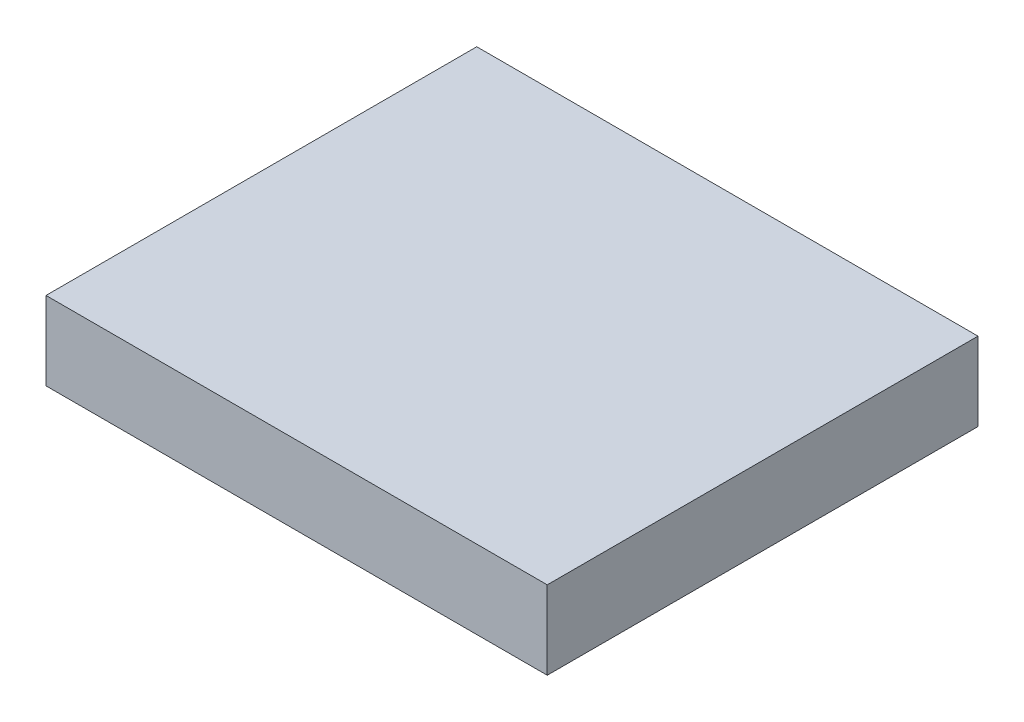
ISO-10303-21;
HEADER;
FILE_DESCRIPTION(('STEP AP214'),'2;1');
FILE_NAME('part.step','',(''),(''),'','','');
FILE_SCHEMA(('AUTOMOTIVE_DESIGN { 1 0 10303 214 1 1 1 1 }'));
ENDSEC;
DATA;
#1=APPLICATION_CONTEXT('core data for automotive mechanical design processes');
#2=APPLICATION_PROTOCOL_DEFINITION('international standard','automotive_design',2000,#1);
#3=PRODUCT_CONTEXT('',#1,'mechanical');
#4=PRODUCT('Part','Part','',(#3));
#5=PRODUCT_RELATED_PRODUCT_CATEGORY('part','',(#4));
#6=PRODUCT_DEFINITION_FORMATION('','',#4);
#7=PRODUCT_DEFINITION_CONTEXT('part definition',#1,'design');
#8=PRODUCT_DEFINITION('design','',#6,#7);
#9=PRODUCT_DEFINITION_SHAPE('','',#8);
#10=(LENGTH_UNIT() NAMED_UNIT(*) SI_UNIT(.MILLI.,.METRE.));
#11=(NAMED_UNIT(*) PLANE_ANGLE_UNIT() SI_UNIT($,.RADIAN.));
#12=(NAMED_UNIT(*) SI_UNIT($,.STERADIAN.) SOLID_ANGLE_UNIT());
#13=UNCERTAINTY_MEASURE_WITH_UNIT(LENGTH_MEASURE(1.E-05),#10,'distance_accuracy_value','');
#14=(GEOMETRIC_REPRESENTATION_CONTEXT(3) GLOBAL_UNCERTAINTY_ASSIGNED_CONTEXT((#13)) GLOBAL_UNIT_ASSIGNED_CONTEXT((#10,
#11,#12)) REPRESENTATION_CONTEXT('',''));
#15=CARTESIAN_POINT('',(0.,0.,0.));
#16=DIRECTION('',(0.,0.,1.));
#17=DIRECTION('',(1.,0.,0.));
#18=AXIS2_PLACEMENT_3D('',#15,#16,#17);
#19=CARTESIAN_POINT('',(406.4,127.,-349.25));
#20=DIRECTION('',(-1.,0.,0.));
#21=DIRECTION('',(0.,0.,1.));
#22=AXIS2_PLACEMENT_3D('',#19,#20,#21);
#23=PLANE('',#22);
#24=DIRECTION('',(0.,0.,-1.));
#25=VECTOR('',#24,1.);
#26=CARTESIAN_POINT('',(406.4,0.,-349.25));
#27=LINE('',#26,#25);
#28=CARTESIAN_POINT('',(406.4,0.,349.25));
#29=VERTEX_POINT('',#28);
#30=CARTESIAN_POINT('',(406.4,0.,-349.25));
#31=VERTEX_POINT('',#30);
#32=EDGE_CURVE('E107',#29,#31,#27,.T.);
#33=ORIENTED_EDGE('',*,*,#32,.T.);
#34=DIRECTION('',(0.,-1.,0.));
#35=VECTOR('',#34,1.);
#36=CARTESIAN_POINT('',(406.4,127.,-349.25));
#37=LINE('',#36,#35);
#38=CARTESIAN_POINT('',(406.4,127.,-349.25));
#39=VERTEX_POINT('',#38);
#40=EDGE_CURVE('E11',#39,#31,#37,.T.);
#41=ORIENTED_EDGE('',*,*,#40,.F.);
#42=DIRECTION('',(0.,0.,-1.));
#43=VECTOR('',#42,1.);
#44=CARTESIAN_POINT('',(406.4,127.,-349.25));
#45=LINE('',#44,#43);
#46=CARTESIAN_POINT('',(406.4,127.,349.25));
#47=VERTEX_POINT('',#46);
#48=EDGE_CURVE('E91',#47,#39,#45,.T.);
#49=ORIENTED_EDGE('',*,*,#48,.F.);
#50=DIRECTION('',(0.,-1.,0.));
#51=VECTOR('',#50,1.);
#52=CARTESIAN_POINT('',(406.4,127.,349.25));
#53=LINE('',#52,#51);
#54=EDGE_CURVE('E103',#47,#29,#53,.T.);
#55=ORIENTED_EDGE('',*,*,#54,.T.);
#56=EDGE_LOOP('',(#33,#41,#49,#55));
#57=FACE_BOUND('',#56,.T.);
#58=ADVANCED_FACE('F39',(#57),#23,.F.);
#59=CARTESIAN_POINT('',(-406.4,127.,-349.25));
#60=DIRECTION('',(0.,0.,1.));
#61=DIRECTION('',(1.,0.,0.));
#62=AXIS2_PLACEMENT_3D('',#59,#60,#61);
#63=PLANE('',#62);
#64=DIRECTION('',(-1.,0.,0.));
#65=VECTOR('',#64,1.);
#66=CARTESIAN_POINT('',(-406.4,0.,-349.25));
#67=LINE('',#66,#65);
#68=CARTESIAN_POINT('',(-406.4,0.,-349.25));
#69=VERTEX_POINT('',#68);
#70=EDGE_CURVE('E96',#31,#69,#67,.T.);
#71=ORIENTED_EDGE('',*,*,#70,.T.);
#72=DIRECTION('',(0.,-1.,0.));
#73=VECTOR('',#72,1.);
#74=CARTESIAN_POINT('',(-406.4,127.,-349.25));
#75=LINE('',#74,#73);
#76=CARTESIAN_POINT('',(-406.4,127.,-349.25));
#77=VERTEX_POINT('',#76);
#78=EDGE_CURVE('E48',#77,#69,#75,.T.);
#79=ORIENTED_EDGE('',*,*,#78,.F.);
#80=DIRECTION('',(-1.,0.,0.));
#81=VECTOR('',#80,1.);
#82=CARTESIAN_POINT('',(-406.4,127.,-349.25));
#83=LINE('',#82,#81);
#84=EDGE_CURVE('E86',#39,#77,#83,.T.);
#85=ORIENTED_EDGE('',*,*,#84,.F.);
#86=ORIENTED_EDGE('',*,*,#40,.T.);
#87=EDGE_LOOP('',(#71,#79,#85,#86));
#88=FACE_BOUND('',#87,.T.);
#89=ADVANCED_FACE('F95',(#88),#63,.F.);
#90=CARTESIAN_POINT('',(-406.4,127.,-349.25));
#91=DIRECTION('',(1.,0.,0.));
#92=DIRECTION('',(0.,0.,-1.));
#93=AXIS2_PLACEMENT_3D('',#90,#91,#92);
#94=PLANE('',#93);
#95=DIRECTION('',(0.,0.,1.));
#96=VECTOR('',#95,1.);
#97=CARTESIAN_POINT('',(-406.4,0.,-349.25));
#98=LINE('',#97,#96);
#99=CARTESIAN_POINT('',(-406.4,0.,349.25));
#100=VERTEX_POINT('',#99);
#101=EDGE_CURVE('E73',#69,#100,#98,.T.);
#102=ORIENTED_EDGE('',*,*,#101,.T.);
#103=DIRECTION('',(0.,-1.,0.));
#104=VECTOR('',#103,1.);
#105=CARTESIAN_POINT('',(-406.4,127.,349.25));
#106=LINE('',#105,#104);
#107=CARTESIAN_POINT('',(-406.4,127.,349.25));
#108=VERTEX_POINT('',#107);
#109=EDGE_CURVE('E98',#108,#100,#106,.T.);
#110=ORIENTED_EDGE('',*,*,#109,.F.);
#111=DIRECTION('',(0.,0.,1.));
#112=VECTOR('',#111,1.);
#113=CARTESIAN_POINT('',(-406.4,127.,-349.25));
#114=LINE('',#113,#112);
#115=EDGE_CURVE('E89',#77,#108,#114,.T.);
#116=ORIENTED_EDGE('',*,*,#115,.F.);
#117=ORIENTED_EDGE('',*,*,#78,.T.);
#118=EDGE_LOOP('',(#102,#110,#116,#117));
#119=FACE_BOUND('',#118,.T.);
#120=ADVANCED_FACE('F99',(#119),#94,.F.);
#121=CARTESIAN_POINT('',(-406.4,127.,349.25));
#122=DIRECTION('',(0.,0.,-1.));
#123=DIRECTION('',(-1.,0.,0.));
#124=AXIS2_PLACEMENT_3D('',#121,#122,#123);
#125=PLANE('',#124);
#126=DIRECTION('',(1.,0.,0.));
#127=VECTOR('',#126,1.);
#128=CARTESIAN_POINT('',(-406.4,0.,349.25));
#129=LINE('',#128,#127);
#130=EDGE_CURVE('E79',#100,#29,#129,.T.);
#131=ORIENTED_EDGE('',*,*,#130,.T.);
#132=ORIENTED_EDGE('',*,*,#54,.F.);
#133=DIRECTION('',(1.,0.,0.));
#134=VECTOR('',#133,1.);
#135=CARTESIAN_POINT('',(-406.4,127.,349.25));
#136=LINE('',#135,#134);
#137=EDGE_CURVE('E56',#108,#47,#136,.T.);
#138=ORIENTED_EDGE('',*,*,#137,.F.);
#139=ORIENTED_EDGE('',*,*,#109,.T.);
#140=EDGE_LOOP('',(#131,#132,#138,#139));
#141=FACE_BOUND('',#140,.T.);
#142=ADVANCED_FACE('F120',(#141),#125,.F.);
#143=CARTESIAN_POINT('',(0.,127.,0.));
#144=DIRECTION('',(0.,1.,0.));
#145=DIRECTION('',(0.,0.,1.));
#146=AXIS2_PLACEMENT_3D('',#143,#144,#145);
#147=PLANE('',#146);
#148=ORIENTED_EDGE('',*,*,#48,.T.);
#149=ORIENTED_EDGE('',*,*,#84,.T.);
#150=ORIENTED_EDGE('',*,*,#115,.T.);
#151=ORIENTED_EDGE('',*,*,#137,.T.);
#152=EDGE_LOOP('',(#148,#149,#150,#151));
#153=FACE_BOUND('',#152,.T.);
#154=ADVANCED_FACE('F87',(#153),#147,.T.);
#155=CARTESIAN_POINT('',(0.,0.,0.));
#156=DIRECTION('',(0.,1.,0.));
#157=DIRECTION('',(0.,0.,1.));
#158=AXIS2_PLACEMENT_3D('',#155,#156,#157);
#159=PLANE('',#158);
#160=ORIENTED_EDGE('',*,*,#32,.F.);
#161=ORIENTED_EDGE('',*,*,#130,.F.);
#162=ORIENTED_EDGE('',*,*,#101,.F.);
#163=ORIENTED_EDGE('',*,*,#70,.F.);
#164=EDGE_LOOP('',(#160,#161,#162,#163));
#165=FACE_BOUND('',#164,.T.);
#166=ADVANCED_FACE('F123',(#165),#159,.F.);
#167=CLOSED_SHELL('',(#58,#89,#120,#142,#154,#166));
#168=MANIFOLD_SOLID_BREP('B2',#167);
#169=ADVANCED_BREP_SHAPE_REPRESENTATION('',(#18,#168),#14);
#170=SHAPE_DEFINITION_REPRESENTATION(#9,#169);
ENDSEC;
END-ISO-10303-21;
